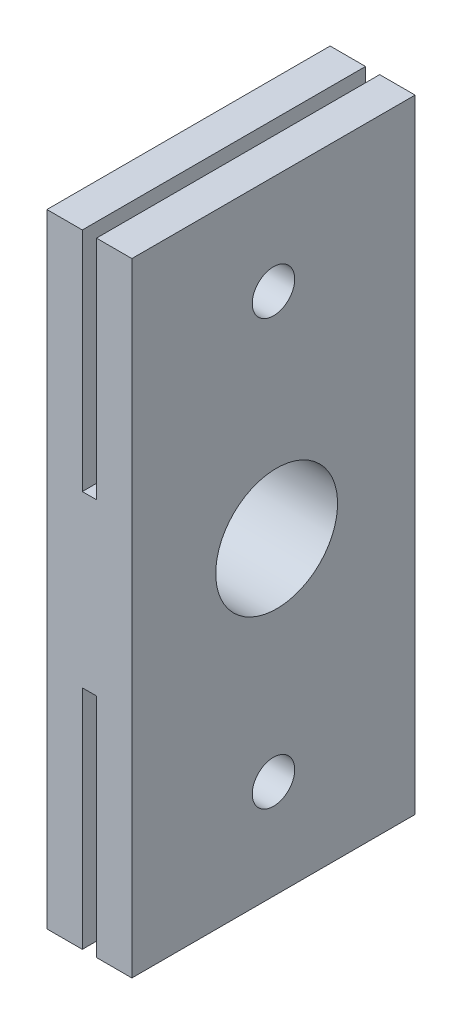
ISO-10303-21;
HEADER;
FILE_DESCRIPTION(('STEP AP214'),'2;1');
FILE_NAME('part.step','',(''),(''),'','','');
FILE_SCHEMA(('AUTOMOTIVE_DESIGN { 1 0 10303 214 1 1 1 1 }'));
ENDSEC;
DATA;
#1=APPLICATION_CONTEXT('core data for automotive mechanical design processes');
#2=APPLICATION_PROTOCOL_DEFINITION('international standard','automotive_design',2000,#1);
#3=PRODUCT_CONTEXT('',#1,'mechanical');
#4=PRODUCT('Part','Part','',(#3));
#5=PRODUCT_RELATED_PRODUCT_CATEGORY('part','',(#4));
#6=PRODUCT_DEFINITION_FORMATION('','',#4);
#7=PRODUCT_DEFINITION_CONTEXT('part definition',#1,'design');
#8=PRODUCT_DEFINITION('design','',#6,#7);
#9=PRODUCT_DEFINITION_SHAPE('','',#8);
#10=(LENGTH_UNIT() NAMED_UNIT(*) SI_UNIT(.MILLI.,.METRE.));
#11=(NAMED_UNIT(*) PLANE_ANGLE_UNIT() SI_UNIT($,.RADIAN.));
#12=(NAMED_UNIT(*) SI_UNIT($,.STERADIAN.) SOLID_ANGLE_UNIT());
#13=UNCERTAINTY_MEASURE_WITH_UNIT(LENGTH_MEASURE(1.E-05),#10,'distance_accuracy_value','');
#14=(GEOMETRIC_REPRESENTATION_CONTEXT(3) GLOBAL_UNCERTAINTY_ASSIGNED_CONTEXT((#13)) GLOBAL_UNIT_ASSIGNED_CONTEXT((#10,
#11,#12)) REPRESENTATION_CONTEXT('',''));
#15=CARTESIAN_POINT('',(0.,0.,0.));
#16=DIRECTION('',(0.,0.,1.));
#17=DIRECTION('',(1.,0.,0.));
#18=AXIS2_PLACEMENT_3D('',#15,#16,#17);
#19=CARTESIAN_POINT('',(2.5,22.,20.));
#20=DIRECTION('',(0.,-1.,0.));
#21=DIRECTION('',(0.,0.,-1.));
#22=AXIS2_PLACEMENT_3D('',#19,#20,#21);
#23=PLANE('',#22);
#24=DIRECTION('',(-1.,0.,0.));
#25=VECTOR('',#24,1.);
#26=CARTESIAN_POINT('',(2.5,22.,0.));
#27=LINE('',#26,#25);
#28=CARTESIAN_POINT('',(2.5,22.,0.));
#29=VERTEX_POINT('',#28);
#30=CARTESIAN_POINT('',(0.,22.,0.));
#31=VERTEX_POINT('',#30);
#32=EDGE_CURVE('E161',#29,#31,#27,.T.);
#33=ORIENTED_EDGE('',*,*,#32,.T.);
#34=DIRECTION('',(0.,0.,-1.));
#35=VECTOR('',#34,1.);
#36=CARTESIAN_POINT('',(0.,22.,20.));
#37=LINE('',#36,#35);
#38=CARTESIAN_POINT('',(0.,22.,20.));
#39=VERTEX_POINT('',#38);
#40=EDGE_CURVE('E12',#39,#31,#37,.T.);
#41=ORIENTED_EDGE('',*,*,#40,.F.);
#42=DIRECTION('',(-1.,0.,0.));
#43=VECTOR('',#42,1.);
#44=CARTESIAN_POINT('',(2.5,22.,20.));
#45=LINE('',#44,#43);
#46=CARTESIAN_POINT('',(2.5,22.,20.));
#47=VERTEX_POINT('',#46);
#48=EDGE_CURVE('E184',#47,#39,#45,.T.);
#49=ORIENTED_EDGE('',*,*,#48,.F.);
#50=DIRECTION('',(0.,0.,-1.));
#51=VECTOR('',#50,1.);
#52=CARTESIAN_POINT('',(2.5,22.,20.));
#53=LINE('',#52,#51);
#54=EDGE_CURVE('E157',#47,#29,#53,.T.);
#55=ORIENTED_EDGE('',*,*,#54,.T.);
#56=EDGE_LOOP('',(#33,#41,#49,#55));
#57=FACE_BOUND('',#56,.T.);
#58=ADVANCED_FACE('F38',(#57),#23,.F.);
#59=CARTESIAN_POINT('',(0.,22.,20.));
#60=DIRECTION('',(1.,0.,0.));
#61=DIRECTION('',(0.,0.,-1.));
#62=AXIS2_PLACEMENT_3D('',#59,#60,#61);
#63=PLANE('',#62);
#64=CARTESIAN_POINT('',(0.,0.,10.007371930027));
#65=DIRECTION('',(1.,0.,0.));
#66=DIRECTION('',(0.,0.706846192153566,0.707367274220404));
#67=AXIS2_PLACEMENT_3D('',#64,#65,#66);
#68=ELLIPSE('',#67,4.30634219667333,4.3);
#69=CARTESIAN_POINT('',(0.,3.04392158382877,13.0535374715481));
#70=VERTEX_POINT('',#69);
#71=EDGE_CURVE('E42',#70,#70,#68,.F.);
#72=ORIENTED_EDGE('',*,*,#71,.F.);
#73=EDGE_LOOP('',(#72));
#74=FACE_BOUND('',#73,.T.);
#75=CARTESIAN_POINT('',(0.,-15.,10.));
#76=DIRECTION('',(-1.,0.,0.));
#77=DIRECTION('',(0.,0.,1.));
#78=AXIS2_PLACEMENT_3D('',#75,#76,#77);
#79=CIRCLE('',#78,1.5);
#80=CARTESIAN_POINT('',(0.,-15.,11.5));
#81=VERTEX_POINT('',#80);
#82=EDGE_CURVE('E213',#81,#81,#79,.T.);
#83=ORIENTED_EDGE('',*,*,#82,.F.);
#84=EDGE_LOOP('',(#83));
#85=FACE_BOUND('',#84,.T.);
#86=CARTESIAN_POINT('',(0.,15.,10.));
#87=DIRECTION('',(-1.,0.,0.));
#88=DIRECTION('',(0.,0.,1.));
#89=AXIS2_PLACEMENT_3D('',#86,#87,#88);
#90=CIRCLE('',#89,1.5);
#91=CARTESIAN_POINT('',(0.,15.,11.5));
#92=VERTEX_POINT('',#91);
#93=EDGE_CURVE('E232',#92,#92,#90,.T.);
#94=ORIENTED_EDGE('',*,*,#93,.F.);
#95=EDGE_LOOP('',(#94));
#96=FACE_BOUND('',#95,.T.);
#97=DIRECTION('',(0.,-1.,0.));
#98=VECTOR('',#97,1.);
#99=CARTESIAN_POINT('',(0.,22.,0.));
#100=LINE('',#99,#98);
#101=CARTESIAN_POINT('',(0.,-22.,0.));
#102=VERTEX_POINT('',#101);
#103=EDGE_CURVE('E164',#31,#102,#100,.T.);
#104=ORIENTED_EDGE('',*,*,#103,.T.);
#105=DIRECTION('',(0.,0.,-1.));
#106=VECTOR('',#105,1.);
#107=CARTESIAN_POINT('',(0.,-22.,20.));
#108=LINE('',#107,#106);
#109=CARTESIAN_POINT('',(0.,-22.,20.));
#110=VERTEX_POINT('',#109);
#111=EDGE_CURVE('E48',#110,#102,#108,.T.);
#112=ORIENTED_EDGE('',*,*,#111,.F.);
#113=DIRECTION('',(0.,-1.,0.));
#114=VECTOR('',#113,1.);
#115=CARTESIAN_POINT('',(0.,22.,20.));
#116=LINE('',#115,#114);
#117=EDGE_CURVE('E112',#39,#110,#116,.T.);
#118=ORIENTED_EDGE('',*,*,#117,.F.);
#119=ORIENTED_EDGE('',*,*,#40,.T.);
#120=EDGE_LOOP('',(#104,#112,#118,#119));
#121=FACE_BOUND('',#120,.T.);
#122=ADVANCED_FACE('F223',(#74,#85,#96,#121),#63,.F.);
#123=CARTESIAN_POINT('',(0.,-22.,20.));
#124=DIRECTION('',(0.,1.,0.));
#125=DIRECTION('',(0.,0.,1.));
#126=AXIS2_PLACEMENT_3D('',#123,#124,#125);
#127=PLANE('',#126);
#128=DIRECTION('',(1.,0.,0.));
#129=VECTOR('',#128,1.);
#130=CARTESIAN_POINT('',(0.,-22.,0.));
#131=LINE('',#130,#129);
#132=CARTESIAN_POINT('',(2.5,-22.,0.));
#133=VERTEX_POINT('',#132);
#134=EDGE_CURVE('E167',#102,#133,#131,.T.);
#135=ORIENTED_EDGE('',*,*,#134,.T.);
#136=DIRECTION('',(0.,0.,-1.));
#137=VECTOR('',#136,1.);
#138=CARTESIAN_POINT('',(2.5,-22.,20.));
#139=LINE('',#138,#137);
#140=CARTESIAN_POINT('',(2.5,-22.,20.));
#141=VERTEX_POINT('',#140);
#142=EDGE_CURVE('E203',#141,#133,#139,.T.);
#143=ORIENTED_EDGE('',*,*,#142,.F.);
#144=DIRECTION('',(1.,0.,0.));
#145=VECTOR('',#144,1.);
#146=CARTESIAN_POINT('',(0.,-22.,20.));
#147=LINE('',#146,#145);
#148=EDGE_CURVE('E240',#110,#141,#147,.T.);
#149=ORIENTED_EDGE('',*,*,#148,.F.);
#150=ORIENTED_EDGE('',*,*,#111,.T.);
#151=EDGE_LOOP('',(#135,#143,#149,#150));
#152=FACE_BOUND('',#151,.T.);
#153=ADVANCED_FACE('F226',(#152),#127,.F.);
#154=CARTESIAN_POINT('',(2.5,-22.,20.));
#155=DIRECTION('',(-1.,0.,0.));
#156=DIRECTION('',(0.,0.,1.));
#157=AXIS2_PLACEMENT_3D('',#154,#155,#156);
#158=PLANE('',#157);
#159=CARTESIAN_POINT('',(2.5,-15.,10.));
#160=DIRECTION('',(-1.,0.,0.));
#161=DIRECTION('',(0.,0.,1.));
#162=AXIS2_PLACEMENT_3D('',#159,#160,#161);
#163=CIRCLE('',#162,1.5);
#164=CARTESIAN_POINT('',(2.5,-15.,11.5));
#165=VERTEX_POINT('',#164);
#166=EDGE_CURVE('E323',#165,#165,#163,.T.);
#167=ORIENTED_EDGE('',*,*,#166,.T.);
#168=EDGE_LOOP('',(#167));
#169=FACE_BOUND('',#168,.T.);
#170=DIRECTION('',(0.,1.,0.));
#171=VECTOR('',#170,1.);
#172=CARTESIAN_POINT('',(2.5,-22.,0.));
#173=LINE('',#172,#171);
#174=CARTESIAN_POINT('',(2.5,-6.,0.));
#175=VERTEX_POINT('',#174);
#176=EDGE_CURVE('E169',#133,#175,#173,.T.);
#177=ORIENTED_EDGE('',*,*,#176,.T.);
#178=DIRECTION('',(0.,0.,-1.));
#179=VECTOR('',#178,1.);
#180=CARTESIAN_POINT('',(2.5,-6.,20.));
#181=LINE('',#180,#179);
#182=CARTESIAN_POINT('',(2.5,-6.,20.));
#183=VERTEX_POINT('',#182);
#184=EDGE_CURVE('E200',#183,#175,#181,.T.);
#185=ORIENTED_EDGE('',*,*,#184,.F.);
#186=DIRECTION('',(0.,1.,0.));
#187=VECTOR('',#186,1.);
#188=CARTESIAN_POINT('',(2.5,-22.,20.));
#189=LINE('',#188,#187);
#190=EDGE_CURVE('E256',#141,#183,#189,.T.);
#191=ORIENTED_EDGE('',*,*,#190,.F.);
#192=ORIENTED_EDGE('',*,*,#142,.T.);
#193=EDGE_LOOP('',(#177,#185,#191,#192));
#194=FACE_BOUND('',#193,.T.);
#195=ADVANCED_FACE('F247',(#169,#194),#158,.F.);
#196=CARTESIAN_POINT('',(2.5,-6.,20.));
#197=DIRECTION('',(0.,1.,0.));
#198=DIRECTION('',(0.,0.,1.));
#199=AXIS2_PLACEMENT_3D('',#196,#197,#198);
#200=PLANE('',#199);
#201=DIRECTION('',(1.,0.,0.));
#202=VECTOR('',#201,1.);
#203=CARTESIAN_POINT('',(2.5,-6.,0.));
#204=LINE('',#203,#202);
#205=CARTESIAN_POINT('',(3.5,-6.,0.));
#206=VERTEX_POINT('',#205);
#207=EDGE_CURVE('E171',#175,#206,#204,.T.);
#208=ORIENTED_EDGE('',*,*,#207,.T.);
#209=DIRECTION('',(0.,0.,-1.));
#210=VECTOR('',#209,1.);
#211=CARTESIAN_POINT('',(3.5,-6.,20.));
#212=LINE('',#211,#210);
#213=CARTESIAN_POINT('',(3.5,-6.,20.));
#214=VERTEX_POINT('',#213);
#215=EDGE_CURVE('E197',#214,#206,#212,.T.);
#216=ORIENTED_EDGE('',*,*,#215,.F.);
#217=DIRECTION('',(1.,0.,0.));
#218=VECTOR('',#217,1.);
#219=CARTESIAN_POINT('',(2.5,-6.,20.));
#220=LINE('',#219,#218);
#221=EDGE_CURVE('E253',#183,#214,#220,.T.);
#222=ORIENTED_EDGE('',*,*,#221,.F.);
#223=ORIENTED_EDGE('',*,*,#184,.T.);
#224=EDGE_LOOP('',(#208,#216,#222,#223));
#225=FACE_BOUND('',#224,.T.);
#226=ADVANCED_FACE('F251',(#225),#200,.F.);
#227=CARTESIAN_POINT('',(3.5,-6.,20.));
#228=DIRECTION('',(1.,0.,0.));
#229=DIRECTION('',(0.,1.,0.));
#230=AXIS2_PLACEMENT_3D('',#227,#228,#229);
#231=PLANE('',#230);
#232=CARTESIAN_POINT('',(3.5,-15.,10.));
#233=DIRECTION('',(1.,0.,0.));
#234=DIRECTION('',(0.,1.,0.));
#235=AXIS2_PLACEMENT_3D('',#232,#233,#234);
#236=CIRCLE('',#235,1.5);
#237=CARTESIAN_POINT('',(3.5,-13.5,10.));
#238=VERTEX_POINT('',#237);
#239=EDGE_CURVE('E328',#238,#238,#236,.T.);
#240=ORIENTED_EDGE('',*,*,#239,.T.);
#241=EDGE_LOOP('',(#240));
#242=FACE_BOUND('',#241,.T.);
#243=DIRECTION('',(0.,-1.,0.));
#244=VECTOR('',#243,1.);
#245=CARTESIAN_POINT('',(3.5,-6.,0.));
#246=LINE('',#245,#244);
#247=CARTESIAN_POINT('',(3.5,-22.,0.));
#248=VERTEX_POINT('',#247);
#249=EDGE_CURVE('E173',#206,#248,#246,.T.);
#250=ORIENTED_EDGE('',*,*,#249,.T.);
#251=DIRECTION('',(0.,0.,-1.));
#252=VECTOR('',#251,1.);
#253=CARTESIAN_POINT('',(3.5,-22.,20.));
#254=LINE('',#253,#252);
#255=CARTESIAN_POINT('',(3.5,-22.,20.));
#256=VERTEX_POINT('',#255);
#257=EDGE_CURVE('E194',#256,#248,#254,.T.);
#258=ORIENTED_EDGE('',*,*,#257,.F.);
#259=DIRECTION('',(0.,-1.,0.));
#260=VECTOR('',#259,1.);
#261=CARTESIAN_POINT('',(3.5,-6.,20.));
#262=LINE('',#261,#260);
#263=EDGE_CURVE('E255',#214,#256,#262,.T.);
#264=ORIENTED_EDGE('',*,*,#263,.F.);
#265=ORIENTED_EDGE('',*,*,#215,.T.);
#266=EDGE_LOOP('',(#250,#258,#264,#265));
#267=FACE_BOUND('',#266,.T.);
#268=ADVANCED_FACE('F299',(#242,#267),#231,.F.);
#269=CARTESIAN_POINT('',(3.5,-22.,20.));
#270=DIRECTION('',(0.,1.,0.));
#271=DIRECTION('',(0.,0.,1.));
#272=AXIS2_PLACEMENT_3D('',#269,#270,#271);
#273=PLANE('',#272);
#274=DIRECTION('',(1.,0.,0.));
#275=VECTOR('',#274,1.);
#276=CARTESIAN_POINT('',(3.5,-22.,0.));
#277=LINE('',#276,#275);
#278=CARTESIAN_POINT('',(6.00000000000001,-22.,0.));
#279=VERTEX_POINT('',#278);
#280=EDGE_CURVE('E175',#248,#279,#277,.T.);
#281=ORIENTED_EDGE('',*,*,#280,.T.);
#282=DIRECTION('',(0.,0.,-1.));
#283=VECTOR('',#282,1.);
#284=CARTESIAN_POINT('',(6.00000000000001,-22.,20.));
#285=LINE('',#284,#283);
#286=CARTESIAN_POINT('',(6.00000000000001,-22.,20.));
#287=VERTEX_POINT('',#286);
#288=EDGE_CURVE('E191',#287,#279,#285,.T.);
#289=ORIENTED_EDGE('',*,*,#288,.F.);
#290=DIRECTION('',(1.,0.,0.));
#291=VECTOR('',#290,1.);
#292=CARTESIAN_POINT('',(3.5,-22.,20.));
#293=LINE('',#292,#291);
#294=EDGE_CURVE('E258',#256,#287,#293,.T.);
#295=ORIENTED_EDGE('',*,*,#294,.F.);
#296=ORIENTED_EDGE('',*,*,#257,.T.);
#297=EDGE_LOOP('',(#281,#289,#295,#296));
#298=FACE_BOUND('',#297,.T.);
#299=ADVANCED_FACE('F302',(#298),#273,.F.);
#300=CARTESIAN_POINT('',(6.00000000000001,-22.,20.));
#301=DIRECTION('',(-1.,0.,0.));
#302=DIRECTION('',(0.,0.,1.));
#303=AXIS2_PLACEMENT_3D('',#300,#301,#302);
#304=PLANE('',#303);
#305=CARTESIAN_POINT('',(6.00000000000001,-0.230428862169834,9.77677319731231));
#306=DIRECTION('',(-1.,0.,0.));
#307=DIRECTION('',(0.,0.706846192153566,0.707367274220404));
#308=AXIS2_PLACEMENT_3D('',#305,#306,#307);
#309=ELLIPSE('',#308,4.30634219667333,4.3);
#310=CARTESIAN_POINT('',(6.00000000000001,2.81349272165893,12.8229387388334));
#311=VERTEX_POINT('',#310);
#312=EDGE_CURVE('E211',#311,#311,#309,.T.);
#313=ORIENTED_EDGE('',*,*,#312,.T.);
#314=EDGE_LOOP('',(#313));
#315=FACE_BOUND('',#314,.T.);
#316=CARTESIAN_POINT('',(6.00000000000001,-15.,10.));
#317=DIRECTION('',(-1.,0.,0.));
#318=DIRECTION('',(0.,0.,1.));
#319=AXIS2_PLACEMENT_3D('',#316,#317,#318);
#320=CIRCLE('',#319,1.5);
#321=CARTESIAN_POINT('',(6.00000000000001,-15.,11.5));
#322=VERTEX_POINT('',#321);
#323=EDGE_CURVE('E217',#322,#322,#320,.T.);
#324=ORIENTED_EDGE('',*,*,#323,.T.);
#325=EDGE_LOOP('',(#324));
#326=FACE_BOUND('',#325,.T.);
#327=CARTESIAN_POINT('',(6.00000000000001,15.,10.));
#328=DIRECTION('',(-1.,0.,0.));
#329=DIRECTION('',(0.,0.,1.));
#330=AXIS2_PLACEMENT_3D('',#327,#328,#329);
#331=CIRCLE('',#330,1.5);
#332=CARTESIAN_POINT('',(6.00000000000001,15.,11.5));
#333=VERTEX_POINT('',#332);
#334=EDGE_CURVE('E210',#333,#333,#331,.T.);
#335=ORIENTED_EDGE('',*,*,#334,.T.);
#336=EDGE_LOOP('',(#335));
#337=FACE_BOUND('',#336,.T.);
#338=DIRECTION('',(0.,1.,0.));
#339=VECTOR('',#338,1.);
#340=CARTESIAN_POINT('',(6.00000000000001,-22.,0.));
#341=LINE('',#340,#339);
#342=CARTESIAN_POINT('',(6.00000000000001,22.,0.));
#343=VERTEX_POINT('',#342);
#344=EDGE_CURVE('E177',#279,#343,#341,.T.);
#345=ORIENTED_EDGE('',*,*,#344,.T.);
#346=DIRECTION('',(0.,0.,-1.));
#347=VECTOR('',#346,1.);
#348=CARTESIAN_POINT('',(6.00000000000001,22.,20.));
#349=LINE('',#348,#347);
#350=CARTESIAN_POINT('',(6.00000000000001,22.,20.));
#351=VERTEX_POINT('',#350);
#352=EDGE_CURVE('E188',#351,#343,#349,.T.);
#353=ORIENTED_EDGE('',*,*,#352,.F.);
#354=DIRECTION('',(0.,1.,0.));
#355=VECTOR('',#354,1.);
#356=CARTESIAN_POINT('',(6.00000000000001,-22.,20.));
#357=LINE('',#356,#355);
#358=EDGE_CURVE('E264',#287,#351,#357,.T.);
#359=ORIENTED_EDGE('',*,*,#358,.F.);
#360=ORIENTED_EDGE('',*,*,#288,.T.);
#361=EDGE_LOOP('',(#345,#353,#359,#360));
#362=FACE_BOUND('',#361,.T.);
#363=ADVANCED_FACE('F270',(#315,#326,#337,#362),#304,.F.);
#364=CARTESIAN_POINT('',(6.00000000000001,22.,20.));
#365=DIRECTION('',(0.,-1.,0.));
#366=DIRECTION('',(0.,0.,-1.));
#367=AXIS2_PLACEMENT_3D('',#364,#365,#366);
#368=PLANE('',#367);
#369=DIRECTION('',(-1.,0.,0.));
#370=VECTOR('',#369,1.);
#371=CARTESIAN_POINT('',(6.00000000000001,22.,0.));
#372=LINE('',#371,#370);
#373=CARTESIAN_POINT('',(3.5,22.,0.));
#374=VERTEX_POINT('',#373);
#375=EDGE_CURVE('E179',#343,#374,#372,.T.);
#376=ORIENTED_EDGE('',*,*,#375,.T.);
#377=DIRECTION('',(0.,0.,-1.));
#378=VECTOR('',#377,1.);
#379=CARTESIAN_POINT('',(3.5,22.,20.));
#380=LINE('',#379,#378);
#381=CARTESIAN_POINT('',(3.5,22.,20.));
#382=VERTEX_POINT('',#381);
#383=EDGE_CURVE('E152',#382,#374,#380,.T.);
#384=ORIENTED_EDGE('',*,*,#383,.F.);
#385=DIRECTION('',(-1.,0.,0.));
#386=VECTOR('',#385,1.);
#387=CARTESIAN_POINT('',(6.00000000000001,22.,20.));
#388=LINE('',#387,#386);
#389=EDGE_CURVE('E143',#351,#382,#388,.T.);
#390=ORIENTED_EDGE('',*,*,#389,.F.);
#391=ORIENTED_EDGE('',*,*,#352,.T.);
#392=EDGE_LOOP('',(#376,#384,#390,#391));
#393=FACE_BOUND('',#392,.T.);
#394=ADVANCED_FACE('F274',(#393),#368,.F.);
#395=CARTESIAN_POINT('',(3.5,22.,20.));
#396=DIRECTION('',(1.,0.,0.));
#397=DIRECTION('',(0.,1.,0.));
#398=AXIS2_PLACEMENT_3D('',#395,#396,#397);
#399=PLANE('',#398);
#400=CARTESIAN_POINT('',(3.5,15.,10.));
#401=DIRECTION('',(1.,0.,0.));
#402=DIRECTION('',(0.,1.,0.));
#403=AXIS2_PLACEMENT_3D('',#400,#401,#402);
#404=CIRCLE('',#403,1.5);
#405=CARTESIAN_POINT('',(3.5,16.5,10.));
#406=VERTEX_POINT('',#405);
#407=EDGE_CURVE('E165',#406,#406,#404,.T.);
#408=ORIENTED_EDGE('',*,*,#407,.T.);
#409=EDGE_LOOP('',(#408));
#410=FACE_BOUND('',#409,.T.);
#411=DIRECTION('',(0.,-1.,0.));
#412=VECTOR('',#411,1.);
#413=CARTESIAN_POINT('',(3.5,22.,0.));
#414=LINE('',#413,#412);
#415=CARTESIAN_POINT('',(3.5,6.,0.));
#416=VERTEX_POINT('',#415);
#417=EDGE_CURVE('E151',#374,#416,#414,.T.);
#418=ORIENTED_EDGE('',*,*,#417,.T.);
#419=DIRECTION('',(0.,0.,-1.));
#420=VECTOR('',#419,1.);
#421=CARTESIAN_POINT('',(3.5,6.,20.));
#422=LINE('',#421,#420);
#423=CARTESIAN_POINT('',(3.5,6.,20.));
#424=VERTEX_POINT('',#423);
#425=EDGE_CURVE('E148',#424,#416,#422,.T.);
#426=ORIENTED_EDGE('',*,*,#425,.F.);
#427=DIRECTION('',(0.,-1.,0.));
#428=VECTOR('',#427,1.);
#429=CARTESIAN_POINT('',(3.5,22.,20.));
#430=LINE('',#429,#428);
#431=EDGE_CURVE('E137',#382,#424,#430,.T.);
#432=ORIENTED_EDGE('',*,*,#431,.F.);
#433=ORIENTED_EDGE('',*,*,#383,.T.);
#434=EDGE_LOOP('',(#418,#426,#432,#433));
#435=FACE_BOUND('',#434,.T.);
#436=ADVANCED_FACE('F149',(#410,#435),#399,.F.);
#437=CARTESIAN_POINT('',(3.5,6.,20.));
#438=DIRECTION('',(0.,-1.,0.));
#439=DIRECTION('',(0.,0.,-1.));
#440=AXIS2_PLACEMENT_3D('',#437,#438,#439);
#441=PLANE('',#440);
#442=DIRECTION('',(-1.,0.,0.));
#443=VECTOR('',#442,1.);
#444=CARTESIAN_POINT('',(3.5,6.,0.));
#445=LINE('',#444,#443);
#446=CARTESIAN_POINT('',(2.5,6.,0.));
#447=VERTEX_POINT('',#446);
#448=EDGE_CURVE('E98',#416,#447,#445,.T.);
#449=ORIENTED_EDGE('',*,*,#448,.T.);
#450=DIRECTION('',(0.,0.,-1.));
#451=VECTOR('',#450,1.);
#452=CARTESIAN_POINT('',(2.5,6.,20.));
#453=LINE('',#452,#451);
#454=CARTESIAN_POINT('',(2.5,6.,20.));
#455=VERTEX_POINT('',#454);
#456=EDGE_CURVE('E153',#455,#447,#453,.T.);
#457=ORIENTED_EDGE('',*,*,#456,.F.);
#458=DIRECTION('',(-1.,0.,0.));
#459=VECTOR('',#458,1.);
#460=CARTESIAN_POINT('',(3.5,6.,20.));
#461=LINE('',#460,#459);
#462=EDGE_CURVE('E141',#424,#455,#461,.T.);
#463=ORIENTED_EDGE('',*,*,#462,.F.);
#464=ORIENTED_EDGE('',*,*,#425,.T.);
#465=EDGE_LOOP('',(#449,#457,#463,#464));
#466=FACE_BOUND('',#465,.T.);
#467=ADVANCED_FACE('F155',(#466),#441,.F.);
#468=CARTESIAN_POINT('',(2.5,6.,20.));
#469=DIRECTION('',(-1.,0.,0.));
#470=DIRECTION('',(0.,0.,1.));
#471=AXIS2_PLACEMENT_3D('',#468,#469,#470);
#472=PLANE('',#471);
#473=CARTESIAN_POINT('',(2.5,15.,10.));
#474=DIRECTION('',(-1.,0.,0.));
#475=DIRECTION('',(0.,0.,1.));
#476=AXIS2_PLACEMENT_3D('',#473,#474,#475);
#477=CIRCLE('',#476,1.5);
#478=CARTESIAN_POINT('',(2.5,15.,11.5));
#479=VERTEX_POINT('',#478);
#480=EDGE_CURVE('E208',#479,#479,#477,.T.);
#481=ORIENTED_EDGE('',*,*,#480,.T.);
#482=EDGE_LOOP('',(#481));
#483=FACE_BOUND('',#482,.T.);
#484=DIRECTION('',(0.,1.,0.));
#485=VECTOR('',#484,1.);
#486=CARTESIAN_POINT('',(2.5,6.,0.));
#487=LINE('',#486,#485);
#488=EDGE_CURVE('E104',#447,#29,#487,.T.);
#489=ORIENTED_EDGE('',*,*,#488,.T.);
#490=ORIENTED_EDGE('',*,*,#54,.F.);
#491=DIRECTION('',(0.,1.,0.));
#492=VECTOR('',#491,1.);
#493=CARTESIAN_POINT('',(2.5,6.,20.));
#494=LINE('',#493,#492);
#495=EDGE_CURVE('E57',#455,#47,#494,.T.);
#496=ORIENTED_EDGE('',*,*,#495,.F.);
#497=ORIENTED_EDGE('',*,*,#456,.T.);
#498=EDGE_LOOP('',(#489,#490,#496,#497));
#499=FACE_BOUND('',#498,.T.);
#500=ADVANCED_FACE('F277',(#483,#499),#472,.F.);
#501=CARTESIAN_POINT('',(0.,0.,20.));
#502=DIRECTION('',(0.,0.,1.));
#503=DIRECTION('',(1.,0.,0.));
#504=AXIS2_PLACEMENT_3D('',#501,#502,#503);
#505=PLANE('',#504);
#506=ORIENTED_EDGE('',*,*,#48,.T.);
#507=ORIENTED_EDGE('',*,*,#117,.T.);
#508=ORIENTED_EDGE('',*,*,#148,.T.);
#509=ORIENTED_EDGE('',*,*,#190,.T.);
#510=ORIENTED_EDGE('',*,*,#221,.T.);
#511=ORIENTED_EDGE('',*,*,#263,.T.);
#512=ORIENTED_EDGE('',*,*,#294,.T.);
#513=ORIENTED_EDGE('',*,*,#358,.T.);
#514=ORIENTED_EDGE('',*,*,#389,.T.);
#515=ORIENTED_EDGE('',*,*,#431,.T.);
#516=ORIENTED_EDGE('',*,*,#462,.T.);
#517=ORIENTED_EDGE('',*,*,#495,.T.);
#518=EDGE_LOOP('',(#506,#507,#508,#509,#510,#511,#512,#513,#514,#515,#516,#517));
#519=FACE_BOUND('',#518,.T.);
#520=ADVANCED_FACE('F139',(#519),#505,.T.);
#521=CARTESIAN_POINT('',(0.,0.,0.));
#522=DIRECTION('',(0.,0.,1.));
#523=DIRECTION('',(1.,0.,0.));
#524=AXIS2_PLACEMENT_3D('',#521,#522,#523);
#525=PLANE('',#524);
#526=ORIENTED_EDGE('',*,*,#32,.F.);
#527=ORIENTED_EDGE('',*,*,#488,.F.);
#528=ORIENTED_EDGE('',*,*,#448,.F.);
#529=ORIENTED_EDGE('',*,*,#417,.F.);
#530=ORIENTED_EDGE('',*,*,#375,.F.);
#531=ORIENTED_EDGE('',*,*,#344,.F.);
#532=ORIENTED_EDGE('',*,*,#280,.F.);
#533=ORIENTED_EDGE('',*,*,#249,.F.);
#534=ORIENTED_EDGE('',*,*,#207,.F.);
#535=ORIENTED_EDGE('',*,*,#176,.F.);
#536=ORIENTED_EDGE('',*,*,#134,.F.);
#537=ORIENTED_EDGE('',*,*,#103,.F.);
#538=EDGE_LOOP('',(#526,#527,#528,#529,#530,#531,#532,#533,#534,#535,#536,#537));
#539=FACE_BOUND('',#538,.T.);
#540=ADVANCED_FACE('F242',(#539),#525,.F.);
#541=CARTESIAN_POINT('',(6.00000000000001,15.,10.));
#542=DIRECTION('',(-1.,0.,0.));
#543=DIRECTION('',(0.,0.,1.));
#544=AXIS2_PLACEMENT_3D('',#541,#542,#543);
#545=CYLINDRICAL_SURFACE('',#544,1.5);
#546=ORIENTED_EDGE('',*,*,#93,.T.);
#547=EDGE_LOOP('',(#546));
#548=FACE_BOUND('',#547,.T.);
#549=ORIENTED_EDGE('',*,*,#480,.F.);
#550=EDGE_LOOP('',(#549));
#551=FACE_BOUND('',#550,.T.);
#552=ADVANCED_FACE('F351',(#548,#551),#545,.F.);
#553=ORIENTED_EDGE('',*,*,#334,.F.);
#554=EDGE_LOOP('',(#553));
#555=FACE_BOUND('',#554,.T.);
#556=ORIENTED_EDGE('',*,*,#407,.F.);
#557=EDGE_LOOP('',(#556));
#558=FACE_BOUND('',#557,.T.);
#559=ADVANCED_FACE('F340',(#555,#558),#545,.F.);
#560=CARTESIAN_POINT('',(6.00000000000001,-15.,10.));
#561=DIRECTION('',(-1.,0.,0.));
#562=DIRECTION('',(0.,0.,1.));
#563=AXIS2_PLACEMENT_3D('',#560,#561,#562);
#564=CYLINDRICAL_SURFACE('',#563,1.5);
#565=ORIENTED_EDGE('',*,*,#323,.F.);
#566=EDGE_LOOP('',(#565));
#567=FACE_BOUND('',#566,.T.);
#568=ORIENTED_EDGE('',*,*,#239,.F.);
#569=EDGE_LOOP('',(#568));
#570=FACE_BOUND('',#569,.T.);
#571=ADVANCED_FACE('F336',(#567,#570),#564,.F.);
#572=ORIENTED_EDGE('',*,*,#82,.T.);
#573=EDGE_LOOP('',(#572));
#574=FACE_BOUND('',#573,.T.);
#575=ORIENTED_EDGE('',*,*,#166,.F.);
#576=EDGE_LOOP('',(#575));
#577=FACE_BOUND('',#576,.T.);
#578=ADVANCED_FACE('F339',(#574,#577),#564,.F.);
#579=CARTESIAN_POINT('',(6.37464595051384,-0.244817068852074,9.76237438374478));
#580=DIRECTION('',(-0.998527242754134,0.0383482493989028,0.0383765194600253));
#581=DIRECTION('',(0.0383482493989028,-0.00147275724586568,0.999263350050493));
#582=AXIS2_PLACEMENT_3D('',#579,#580,#581);
#583=CYLINDRICAL_SURFACE('',#582,4.3);
#584=ORIENTED_EDGE('',*,*,#312,.F.);
#585=EDGE_LOOP('',(#584));
#586=FACE_BOUND('',#585,.T.);
#587=ORIENTED_EDGE('',*,*,#71,.T.);
#588=EDGE_LOOP('',(#587));
#589=FACE_BOUND('',#588,.T.);
#590=ADVANCED_FACE('F40',(#586,#589),#583,.F.);
#591=CLOSED_SHELL('',(#58,#122,#153,#195,#226,#268,#299,#363,#394,#436,#467,#500,#520,#540,#552,
#559,#571,#578,#590));
#592=MANIFOLD_SOLID_BREP('B2',#591);
#593=ADVANCED_BREP_SHAPE_REPRESENTATION('',(#18,#592),#14);
#594=SHAPE_DEFINITION_REPRESENTATION(#9,#593);
ENDSEC;
END-ISO-10303-21;
